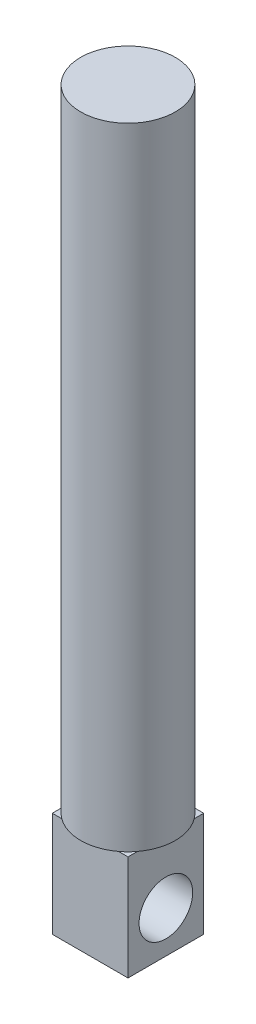
ISO-10303-21;
HEADER;
FILE_DESCRIPTION(('STEP AP214'),'2;1');
FILE_NAME('part.step','',(''),(''),'','','');
FILE_SCHEMA(('AUTOMOTIVE_DESIGN { 1 0 10303 214 1 1 1 1 }'));
ENDSEC;
DATA;
#1=APPLICATION_CONTEXT('core data for automotive mechanical design processes');
#2=APPLICATION_PROTOCOL_DEFINITION('international standard','automotive_design',2000,#1);
#3=PRODUCT_CONTEXT('',#1,'mechanical');
#4=PRODUCT('Part','Part','',(#3));
#5=PRODUCT_RELATED_PRODUCT_CATEGORY('part','',(#4));
#6=PRODUCT_DEFINITION_FORMATION('','',#4);
#7=PRODUCT_DEFINITION_CONTEXT('part definition',#1,'design');
#8=PRODUCT_DEFINITION('design','',#6,#7);
#9=PRODUCT_DEFINITION_SHAPE('','',#8);
#10=(LENGTH_UNIT() NAMED_UNIT(*) SI_UNIT(.MILLI.,.METRE.));
#11=(NAMED_UNIT(*) PLANE_ANGLE_UNIT() SI_UNIT($,.RADIAN.));
#12=(NAMED_UNIT(*) SI_UNIT($,.STERADIAN.) SOLID_ANGLE_UNIT());
#13=UNCERTAINTY_MEASURE_WITH_UNIT(LENGTH_MEASURE(1.E-05),#10,'distance_accuracy_value','');
#14=(GEOMETRIC_REPRESENTATION_CONTEXT(3) GLOBAL_UNCERTAINTY_ASSIGNED_CONTEXT((#13)) GLOBAL_UNIT_ASSIGNED_CONTEXT((#10,
#11,#12)) REPRESENTATION_CONTEXT('',''));
#15=CARTESIAN_POINT('',(0.,0.,0.));
#16=DIRECTION('',(0.,0.,1.));
#17=DIRECTION('',(1.,0.,0.));
#18=AXIS2_PLACEMENT_3D('',#15,#16,#17);
#19=CARTESIAN_POINT('',(0.,8.31,0.));
#20=DIRECTION('',(0.,-1.,0.));
#21=DIRECTION('',(0.,0.,-1.));
#22=AXIS2_PLACEMENT_3D('',#19,#20,#21);
#23=PLANE('',#22);
#24=CARTESIAN_POINT('',(3.,8.31,-3.));
#25=DIRECTION('',(0.,1.,0.));
#26=DIRECTION('',(0.,0.,1.));
#27=AXIS2_PLACEMENT_3D('',#24,#25,#26);
#28=CIRCLE('',#27,3.75);
#29=CARTESIAN_POINT('',(5.25,8.31,0.));
#30=VERTEX_POINT('',#29);
#31=CARTESIAN_POINT('',(6.,8.31,-0.749999999999999));
#32=VERTEX_POINT('',#31);
#33=EDGE_CURVE('E139',#30,#32,#28,.T.);
#34=ORIENTED_EDGE('',*,*,#33,.F.);
#35=DIRECTION('',(1.,0.,0.));
#36=VECTOR('',#35,1.);
#37=CARTESIAN_POINT('',(0.,8.31,0.));
#38=LINE('',#37,#36);
#39=CARTESIAN_POINT('',(6.,8.31,0.));
#40=VERTEX_POINT('',#39);
#41=EDGE_CURVE('E126',#30,#40,#38,.T.);
#42=ORIENTED_EDGE('',*,*,#41,.T.);
#43=DIRECTION('',(0.,0.,-1.));
#44=VECTOR('',#43,1.);
#45=CARTESIAN_POINT('',(6.,8.31,0.));
#46=LINE('',#45,#44);
#47=EDGE_CURVE('E160',#40,#32,#46,.T.);
#48=ORIENTED_EDGE('',*,*,#47,.T.);
#49=EDGE_LOOP('',(#34,#42,#48));
#50=FACE_BOUND('',#49,.T.);
#51=ADVANCED_FACE('F45',(#50),#23,.F.);
#52=CARTESIAN_POINT('',(6.,8.31,-5.25));
#53=VERTEX_POINT('',#52);
#54=CARTESIAN_POINT('',(5.25,8.31,-6.));
#55=VERTEX_POINT('',#54);
#56=EDGE_CURVE('E13',#53,#55,#28,.T.);
#57=ORIENTED_EDGE('',*,*,#56,.F.);
#58=CARTESIAN_POINT('',(6.,8.31,-6.));
#59=VERTEX_POINT('',#58);
#60=EDGE_CURVE('E123',#53,#59,#46,.T.);
#61=ORIENTED_EDGE('',*,*,#60,.T.);
#62=DIRECTION('',(-1.,0.,0.));
#63=VECTOR('',#62,1.);
#64=CARTESIAN_POINT('',(0.,8.31,-6.));
#65=LINE('',#64,#63);
#66=EDGE_CURVE('E156',#59,#55,#65,.T.);
#67=ORIENTED_EDGE('',*,*,#66,.T.);
#68=EDGE_LOOP('',(#57,#61,#67));
#69=FACE_BOUND('',#68,.T.);
#70=ADVANCED_FACE('F212',(#69),#23,.F.);
#71=CARTESIAN_POINT('',(0.749999999999999,8.31,-6.));
#72=VERTEX_POINT('',#71);
#73=CARTESIAN_POINT('',(0.,8.31,-5.25));
#74=VERTEX_POINT('',#73);
#75=EDGE_CURVE('E54',#72,#74,#28,.T.);
#76=ORIENTED_EDGE('',*,*,#75,.F.);
#77=CARTESIAN_POINT('',(0.,8.31,-6.));
#78=VERTEX_POINT('',#77);
#79=EDGE_CURVE('E157',#72,#78,#65,.T.);
#80=ORIENTED_EDGE('',*,*,#79,.T.);
#81=DIRECTION('',(0.,0.,1.));
#82=VECTOR('',#81,1.);
#83=CARTESIAN_POINT('',(0.,8.31,0.));
#84=LINE('',#83,#82);
#85=EDGE_CURVE('E192',#78,#74,#84,.T.);
#86=ORIENTED_EDGE('',*,*,#85,.T.);
#87=EDGE_LOOP('',(#76,#80,#86));
#88=FACE_BOUND('',#87,.T.);
#89=ADVANCED_FACE('F218',(#88),#23,.F.);
#90=CARTESIAN_POINT('',(0.,8.31,0.));
#91=DIRECTION('',(1.,0.,0.));
#92=DIRECTION('',(0.,0.,-1.));
#93=AXIS2_PLACEMENT_3D('',#90,#91,#92);
#94=PLANE('',#93);
#95=CARTESIAN_POINT('',(0.,3.31,-3.));
#96=DIRECTION('',(1.,0.,0.));
#97=DIRECTION('',(0.,0.,-1.));
#98=AXIS2_PLACEMENT_3D('',#95,#96,#97);
#99=CIRCLE('',#98,2.125);
#100=CARTESIAN_POINT('',(0.,3.31,-5.125));
#101=VERTEX_POINT('',#100);
#102=EDGE_CURVE('E167',#101,#101,#99,.T.);
#103=ORIENTED_EDGE('',*,*,#102,.T.);
#104=EDGE_LOOP('',(#103));
#105=FACE_BOUND('',#104,.T.);
#106=DIRECTION('',(0.,0.,1.));
#107=VECTOR('',#106,1.);
#108=CARTESIAN_POINT('',(0.,0.,0.));
#109=LINE('',#108,#107);
#110=CARTESIAN_POINT('',(0.,0.,-6.));
#111=VERTEX_POINT('',#110);
#112=CARTESIAN_POINT('',(0.,0.,0.));
#113=VERTEX_POINT('',#112);
#114=EDGE_CURVE('E163',#111,#113,#109,.T.);
#115=ORIENTED_EDGE('',*,*,#114,.T.);
#116=DIRECTION('',(0.,-1.,0.));
#117=VECTOR('',#116,1.);
#118=CARTESIAN_POINT('',(0.,8.31,0.));
#119=LINE('',#118,#117);
#120=CARTESIAN_POINT('',(0.,8.31,0.));
#121=VERTEX_POINT('',#120);
#122=EDGE_CURVE('E49',#121,#113,#119,.T.);
#123=ORIENTED_EDGE('',*,*,#122,.F.);
#124=CARTESIAN_POINT('',(0.,8.31,-0.749999999999999));
#125=VERTEX_POINT('',#124);
#126=EDGE_CURVE('E119',#125,#121,#84,.T.);
#127=ORIENTED_EDGE('',*,*,#126,.F.);
#128=EDGE_CURVE('E194',#74,#125,#84,.T.);
#129=ORIENTED_EDGE('',*,*,#128,.F.);
#130=ORIENTED_EDGE('',*,*,#85,.F.);
#131=DIRECTION('',(0.,-1.,0.));
#132=VECTOR('',#131,1.);
#133=CARTESIAN_POINT('',(0.,8.31,-6.));
#134=LINE('',#133,#132);
#135=EDGE_CURVE('E159',#78,#111,#134,.T.);
#136=ORIENTED_EDGE('',*,*,#135,.T.);
#137=EDGE_LOOP('',(#115,#123,#127,#129,#130,#136));
#138=FACE_BOUND('',#137,.T.);
#139=ADVANCED_FACE('F47',(#105,#138),#94,.F.);
#140=CARTESIAN_POINT('',(0.,8.31,0.));
#141=DIRECTION('',(0.,0.,-1.));
#142=DIRECTION('',(-1.,0.,0.));
#143=AXIS2_PLACEMENT_3D('',#140,#141,#142);
#144=PLANE('',#143);
#145=DIRECTION('',(1.,0.,0.));
#146=VECTOR('',#145,1.);
#147=CARTESIAN_POINT('',(0.,0.,0.));
#148=LINE('',#147,#146);
#149=CARTESIAN_POINT('',(6.,0.,0.));
#150=VERTEX_POINT('',#149);
#151=EDGE_CURVE('E166',#113,#150,#148,.T.);
#152=ORIENTED_EDGE('',*,*,#151,.T.);
#153=DIRECTION('',(0.,-1.,0.));
#154=VECTOR('',#153,1.);
#155=CARTESIAN_POINT('',(6.,8.31,0.));
#156=LINE('',#155,#154);
#157=EDGE_CURVE('E143',#40,#150,#156,.T.);
#158=ORIENTED_EDGE('',*,*,#157,.F.);
#159=ORIENTED_EDGE('',*,*,#41,.F.);
#160=CARTESIAN_POINT('',(0.749999999999999,8.31,0.));
#161=VERTEX_POINT('',#160);
#162=EDGE_CURVE('E124',#161,#30,#38,.T.);
#163=ORIENTED_EDGE('',*,*,#162,.F.);
#164=EDGE_CURVE('E113',#121,#161,#38,.T.);
#165=ORIENTED_EDGE('',*,*,#164,.F.);
#166=ORIENTED_EDGE('',*,*,#122,.T.);
#167=EDGE_LOOP('',(#152,#158,#159,#163,#165,#166));
#168=FACE_BOUND('',#167,.T.);
#169=ADVANCED_FACE('F130',(#168),#144,.F.);
#170=CARTESIAN_POINT('',(6.,8.31,0.));
#171=DIRECTION('',(-1.,0.,0.));
#172=DIRECTION('',(0.,0.,1.));
#173=AXIS2_PLACEMENT_3D('',#170,#171,#172);
#174=PLANE('',#173);
#175=CARTESIAN_POINT('',(6.,3.31,-3.));
#176=DIRECTION('',(1.,0.,0.));
#177=DIRECTION('',(0.,0.,-1.));
#178=AXIS2_PLACEMENT_3D('',#175,#176,#177);
#179=CIRCLE('',#178,2.125);
#180=CARTESIAN_POINT('',(6.,3.31,-5.125));
#181=VERTEX_POINT('',#180);
#182=EDGE_CURVE('E149',#181,#181,#179,.T.);
#183=ORIENTED_EDGE('',*,*,#182,.F.);
#184=EDGE_LOOP('',(#183));
#185=FACE_BOUND('',#184,.T.);
#186=DIRECTION('',(0.,0.,-1.));
#187=VECTOR('',#186,1.);
#188=CARTESIAN_POINT('',(6.,0.,0.));
#189=LINE('',#188,#187);
#190=CARTESIAN_POINT('',(6.,0.,-6.));
#191=VERTEX_POINT('',#190);
#192=EDGE_CURVE('E169',#150,#191,#189,.T.);
#193=ORIENTED_EDGE('',*,*,#192,.T.);
#194=DIRECTION('',(0.,-1.,0.));
#195=VECTOR('',#194,1.);
#196=CARTESIAN_POINT('',(6.,8.31,-6.));
#197=LINE('',#196,#195);
#198=EDGE_CURVE('E175',#59,#191,#197,.T.);
#199=ORIENTED_EDGE('',*,*,#198,.F.);
#200=ORIENTED_EDGE('',*,*,#60,.F.);
#201=EDGE_CURVE('E339',#32,#53,#46,.T.);
#202=ORIENTED_EDGE('',*,*,#201,.F.);
#203=ORIENTED_EDGE('',*,*,#47,.F.);
#204=ORIENTED_EDGE('',*,*,#157,.T.);
#205=EDGE_LOOP('',(#193,#199,#200,#202,#203,#204));
#206=FACE_BOUND('',#205,.T.);
#207=ADVANCED_FACE('F181',(#185,#206),#174,.F.);
#208=CARTESIAN_POINT('',(0.,8.31,-6.));
#209=DIRECTION('',(0.,0.,1.));
#210=DIRECTION('',(1.,0.,0.));
#211=AXIS2_PLACEMENT_3D('',#208,#209,#210);
#212=PLANE('',#211);
#213=DIRECTION('',(-1.,0.,0.));
#214=VECTOR('',#213,1.);
#215=CARTESIAN_POINT('',(0.,0.,-6.));
#216=LINE('',#215,#214);
#217=EDGE_CURVE('E171',#191,#111,#216,.T.);
#218=ORIENTED_EDGE('',*,*,#217,.T.);
#219=ORIENTED_EDGE('',*,*,#135,.F.);
#220=ORIENTED_EDGE('',*,*,#79,.F.);
#221=EDGE_CURVE('E69',#55,#72,#65,.T.);
#222=ORIENTED_EDGE('',*,*,#221,.F.);
#223=ORIENTED_EDGE('',*,*,#66,.F.);
#224=ORIENTED_EDGE('',*,*,#198,.T.);
#225=EDGE_LOOP('',(#218,#219,#220,#222,#223,#224));
#226=FACE_BOUND('',#225,.T.);
#227=ADVANCED_FACE('F189',(#226),#212,.F.);
#228=EDGE_CURVE('E117',#125,#161,#28,.T.);
#229=ORIENTED_EDGE('',*,*,#228,.F.);
#230=ORIENTED_EDGE('',*,*,#126,.T.);
#231=ORIENTED_EDGE('',*,*,#164,.T.);
#232=EDGE_LOOP('',(#229,#230,#231));
#233=FACE_BOUND('',#232,.T.);
#234=ADVANCED_FACE('F115',(#233),#23,.F.);
#235=CARTESIAN_POINT('',(0.,0.,0.));
#236=DIRECTION('',(0.,-1.,0.));
#237=DIRECTION('',(0.,0.,-1.));
#238=AXIS2_PLACEMENT_3D('',#235,#236,#237);
#239=PLANE('',#238);
#240=ORIENTED_EDGE('',*,*,#114,.F.);
#241=ORIENTED_EDGE('',*,*,#217,.F.);
#242=ORIENTED_EDGE('',*,*,#192,.F.);
#243=ORIENTED_EDGE('',*,*,#151,.F.);
#244=EDGE_LOOP('',(#240,#241,#242,#243));
#245=FACE_BOUND('',#244,.T.);
#246=ADVANCED_FACE('F187',(#245),#239,.T.);
#247=CARTESIAN_POINT('',(-4.,3.31,-3.));
#248=DIRECTION('',(1.,0.,0.));
#249=DIRECTION('',(0.,0.,-1.));
#250=AXIS2_PLACEMENT_3D('',#247,#248,#249);
#251=CYLINDRICAL_SURFACE('',#250,2.125);
#252=ORIENTED_EDGE('',*,*,#182,.T.);
#253=EDGE_LOOP('',(#252));
#254=FACE_BOUND('',#253,.T.);
#255=ORIENTED_EDGE('',*,*,#102,.F.);
#256=EDGE_LOOP('',(#255));
#257=FACE_BOUND('',#256,.T.);
#258=ADVANCED_FACE('F201',(#254,#257),#251,.F.);
#259=CARTESIAN_POINT('',(3.,8.31,-3.));
#260=DIRECTION('',(0.,1.,0.));
#261=DIRECTION('',(0.,0.,1.));
#262=AXIS2_PLACEMENT_3D('',#259,#260,#261);
#263=PLANE('',#262);
#264=EDGE_CURVE('E138',#74,#125,#28,.T.);
#265=ORIENTED_EDGE('',*,*,#264,.F.);
#266=ORIENTED_EDGE('',*,*,#128,.T.);
#267=EDGE_LOOP('',(#265,#266));
#268=FACE_BOUND('',#267,.T.);
#269=ADVANCED_FACE('F235',(#268),#263,.F.);
#270=EDGE_CURVE('E134',#161,#30,#28,.T.);
#271=ORIENTED_EDGE('',*,*,#270,.F.);
#272=ORIENTED_EDGE('',*,*,#162,.T.);
#273=EDGE_LOOP('',(#271,#272));
#274=FACE_BOUND('',#273,.T.);
#275=ADVANCED_FACE('F135',(#274),#263,.F.);
#276=EDGE_CURVE('E56',#32,#53,#28,.T.);
#277=ORIENTED_EDGE('',*,*,#276,.F.);
#278=ORIENTED_EDGE('',*,*,#201,.T.);
#279=EDGE_LOOP('',(#277,#278));
#280=FACE_BOUND('',#279,.T.);
#281=ADVANCED_FACE('F261',(#280),#263,.F.);
#282=EDGE_CURVE('E150',#55,#72,#28,.T.);
#283=ORIENTED_EDGE('',*,*,#282,.F.);
#284=ORIENTED_EDGE('',*,*,#221,.T.);
#285=EDGE_LOOP('',(#283,#284));
#286=FACE_BOUND('',#285,.T.);
#287=ADVANCED_FACE('F155',(#286),#263,.F.);
#288=CARTESIAN_POINT('',(3.,58.31,-3.));
#289=DIRECTION('',(0.,-1.,0.));
#290=DIRECTION('',(0.,0.,-1.));
#291=AXIS2_PLACEMENT_3D('',#288,#289,#290);
#292=CYLINDRICAL_SURFACE('',#291,3.75);
#293=CARTESIAN_POINT('',(3.,58.31,-3.));
#294=DIRECTION('',(0.,1.,0.));
#295=DIRECTION('',(0.,0.,1.));
#296=AXIS2_PLACEMENT_3D('',#293,#294,#295);
#297=CIRCLE('',#296,3.75);
#298=CARTESIAN_POINT('',(3.,58.31,0.75));
#299=VERTEX_POINT('',#298);
#300=EDGE_CURVE('E146',#299,#299,#297,.T.);
#301=ORIENTED_EDGE('',*,*,#300,.F.);
#302=EDGE_LOOP('',(#301));
#303=FACE_BOUND('',#302,.T.);
#304=ORIENTED_EDGE('',*,*,#33,.T.);
#305=ORIENTED_EDGE('',*,*,#276,.T.);
#306=ORIENTED_EDGE('',*,*,#56,.T.);
#307=ORIENTED_EDGE('',*,*,#282,.T.);
#308=ORIENTED_EDGE('',*,*,#75,.T.);
#309=ORIENTED_EDGE('',*,*,#264,.T.);
#310=ORIENTED_EDGE('',*,*,#228,.T.);
#311=ORIENTED_EDGE('',*,*,#270,.T.);
#312=EDGE_LOOP('',(#304,#305,#306,#307,#308,#309,#310,#311));
#313=FACE_BOUND('',#312,.T.);
#314=ADVANCED_FACE('F141',(#303,#313),#292,.T.);
#315=CARTESIAN_POINT('',(3.,58.31,-3.));
#316=DIRECTION('',(0.,1.,0.));
#317=DIRECTION('',(0.,0.,1.));
#318=AXIS2_PLACEMENT_3D('',#315,#316,#317);
#319=PLANE('',#318);
#320=ORIENTED_EDGE('',*,*,#300,.T.);
#321=EDGE_LOOP('',(#320));
#322=FACE_BOUND('',#321,.T.);
#323=ADVANCED_FACE('F243',(#322),#319,.T.);
#324=CLOSED_SHELL('',(#51,#70,#89,#139,#169,#207,#227,#234,#246,#258,#269,#275,#281,#287,#314,#323));
#325=MANIFOLD_SOLID_BREP('B2',#324);
#326=ADVANCED_BREP_SHAPE_REPRESENTATION('',(#18,#325),#14);
#327=SHAPE_DEFINITION_REPRESENTATION(#9,#326);
ENDSEC;
END-ISO-10303-21;
